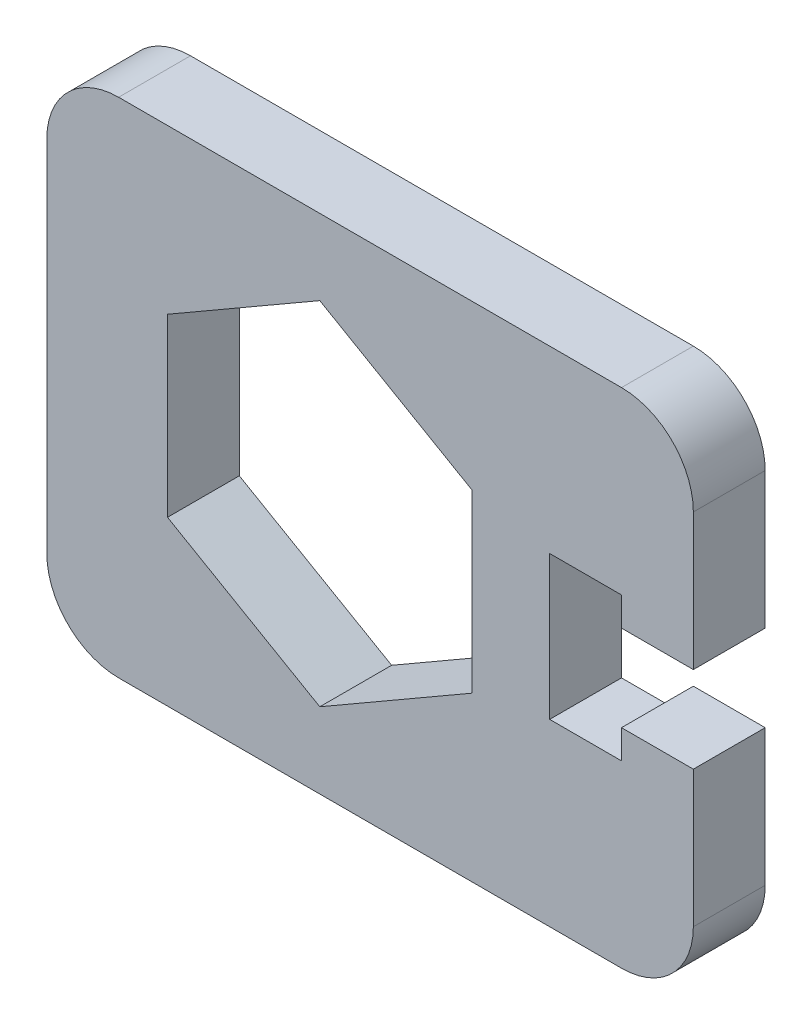
ISO-10303-21;
HEADER;
FILE_DESCRIPTION(('STEP AP214'),'2;1');
FILE_NAME('part.step','',(''),(''),'','','');
FILE_SCHEMA(('AUTOMOTIVE_DESIGN { 1 0 10303 214 1 1 1 1 }'));
ENDSEC;
DATA;
#1=APPLICATION_CONTEXT('core data for automotive mechanical design processes');
#2=APPLICATION_PROTOCOL_DEFINITION('international standard','automotive_design',2000,#1);
#3=PRODUCT_CONTEXT('',#1,'mechanical');
#4=PRODUCT('Part','Part','',(#3));
#5=PRODUCT_RELATED_PRODUCT_CATEGORY('part','',(#4));
#6=PRODUCT_DEFINITION_FORMATION('','',#4);
#7=PRODUCT_DEFINITION_CONTEXT('part definition',#1,'design');
#8=PRODUCT_DEFINITION('design','',#6,#7);
#9=PRODUCT_DEFINITION_SHAPE('','',#8);
#10=(LENGTH_UNIT() NAMED_UNIT(*) SI_UNIT(.MILLI.,.METRE.));
#11=(NAMED_UNIT(*) PLANE_ANGLE_UNIT() SI_UNIT($,.RADIAN.));
#12=(NAMED_UNIT(*) SI_UNIT($,.STERADIAN.) SOLID_ANGLE_UNIT());
#13=UNCERTAINTY_MEASURE_WITH_UNIT(LENGTH_MEASURE(1.E-05),#10,'distance_accuracy_value','');
#14=(GEOMETRIC_REPRESENTATION_CONTEXT(3) GLOBAL_UNCERTAINTY_ASSIGNED_CONTEXT((#13)) GLOBAL_UNIT_ASSIGNED_CONTEXT((#10,
#11,#12)) REPRESENTATION_CONTEXT('',''));
#15=CARTESIAN_POINT('',(0.,0.,0.));
#16=DIRECTION('',(0.,0.,1.));
#17=DIRECTION('',(1.,0.,0.));
#18=AXIS2_PLACEMENT_3D('',#15,#16,#17);
#19=CARTESIAN_POINT('',(0.,0.,2.5));
#20=DIRECTION('',(0.,0.,1.));
#21=DIRECTION('',(1.,0.,0.));
#22=AXIS2_PLACEMENT_3D('',#19,#20,#21);
#23=PLANE('',#22);
#24=DIRECTION('',(0.,1.,0.));
#25=VECTOR('',#24,1.);
#26=CARTESIAN_POINT('',(22.5,3.,2.5));
#27=LINE('',#26,#25);
#28=CARTESIAN_POINT('',(22.5,3.,2.5));
#29=VERTEX_POINT('',#28);
#30=CARTESIAN_POINT('',(22.5,12.5,2.5));
#31=VERTEX_POINT('',#30);
#32=EDGE_CURVE('E266',#29,#31,#27,.T.);
#33=ORIENTED_EDGE('',*,*,#32,.T.);
#34=CARTESIAN_POINT('',(17.5,12.5,2.5));
#35=DIRECTION('',(0.,0.,1.));
#36=DIRECTION('',(1.,0.,0.));
#37=AXIS2_PLACEMENT_3D('',#34,#35,#36);
#38=CIRCLE('',#37,5.);
#39=CARTESIAN_POINT('',(17.5,17.5,2.5));
#40=VERTEX_POINT('',#39);
#41=EDGE_CURVE('E341',#31,#40,#38,.T.);
#42=ORIENTED_EDGE('',*,*,#41,.T.);
#43=DIRECTION('',(-1.,0.,0.));
#44=VECTOR('',#43,1.);
#45=CARTESIAN_POINT('',(22.5,17.5,2.5));
#46=LINE('',#45,#44);
#47=CARTESIAN_POINT('',(-17.5,17.5,2.5));
#48=VERTEX_POINT('',#47);
#49=EDGE_CURVE('E269',#40,#48,#46,.T.);
#50=ORIENTED_EDGE('',*,*,#49,.T.);
#51=CARTESIAN_POINT('',(-17.5,12.5,2.5));
#52=DIRECTION('',(0.,0.,1.));
#53=DIRECTION('',(1.,0.,0.));
#54=AXIS2_PLACEMENT_3D('',#51,#52,#53);
#55=CIRCLE('',#54,5.);
#56=CARTESIAN_POINT('',(-22.5,12.5,2.5));
#57=VERTEX_POINT('',#56);
#58=EDGE_CURVE('E336',#48,#57,#55,.T.);
#59=ORIENTED_EDGE('',*,*,#58,.T.);
#60=DIRECTION('',(0.,-1.,0.));
#61=VECTOR('',#60,1.);
#62=CARTESIAN_POINT('',(-22.5,-17.5,2.5));
#63=LINE('',#62,#61);
#64=CARTESIAN_POINT('',(-22.5,-12.5,2.5));
#65=VERTEX_POINT('',#64);
#66=EDGE_CURVE('E244',#57,#65,#63,.T.);
#67=ORIENTED_EDGE('',*,*,#66,.T.);
#68=CARTESIAN_POINT('',(-17.5,-12.5,2.5));
#69=DIRECTION('',(0.,0.,1.));
#70=DIRECTION('',(1.,0.,0.));
#71=AXIS2_PLACEMENT_3D('',#68,#69,#70);
#72=CIRCLE('',#71,5.);
#73=CARTESIAN_POINT('',(-17.5,-17.5,2.5));
#74=VERTEX_POINT('',#73);
#75=EDGE_CURVE('E338',#65,#74,#72,.T.);
#76=ORIENTED_EDGE('',*,*,#75,.T.);
#77=DIRECTION('',(1.,0.,0.));
#78=VECTOR('',#77,1.);
#79=CARTESIAN_POINT('',(22.5,-17.5,2.5));
#80=LINE('',#79,#78);
#81=CARTESIAN_POINT('',(17.5,-17.5,2.5));
#82=VERTEX_POINT('',#81);
#83=EDGE_CURVE('E247',#74,#82,#80,.T.);
#84=ORIENTED_EDGE('',*,*,#83,.T.);
#85=CARTESIAN_POINT('',(17.5,-12.5,2.5));
#86=DIRECTION('',(0.,0.,1.));
#87=DIRECTION('',(1.,0.,0.));
#88=AXIS2_PLACEMENT_3D('',#85,#86,#87);
#89=CIRCLE('',#88,5.);
#90=CARTESIAN_POINT('',(22.5,-12.5,2.5));
#91=VERTEX_POINT('',#90);
#92=EDGE_CURVE('E52',#82,#91,#89,.T.);
#93=ORIENTED_EDGE('',*,*,#92,.T.);
#94=DIRECTION('',(0.,1.,0.));
#95=VECTOR('',#94,1.);
#96=CARTESIAN_POINT('',(22.5,-17.5,2.5));
#97=LINE('',#96,#95);
#98=CARTESIAN_POINT('',(22.5,-2.99999999999998,2.5));
#99=VERTEX_POINT('',#98);
#100=EDGE_CURVE('E250',#91,#99,#97,.T.);
#101=ORIENTED_EDGE('',*,*,#100,.T.);
#102=DIRECTION('',(-1.,0.,0.));
#103=VECTOR('',#102,1.);
#104=CARTESIAN_POINT('',(17.5,-2.99999999999999,2.5));
#105=LINE('',#104,#103);
#106=CARTESIAN_POINT('',(17.5,-2.99999999999999,2.5));
#107=VERTEX_POINT('',#106);
#108=EDGE_CURVE('E252',#99,#107,#105,.T.);
#109=ORIENTED_EDGE('',*,*,#108,.T.);
#110=DIRECTION('',(0.,-1.,0.));
#111=VECTOR('',#110,1.);
#112=CARTESIAN_POINT('',(17.5,-4.99999999999999,2.5));
#113=LINE('',#112,#111);
#114=CARTESIAN_POINT('',(17.5,-4.99999999999999,2.5));
#115=VERTEX_POINT('',#114);
#116=EDGE_CURVE('E254',#107,#115,#113,.T.);
#117=ORIENTED_EDGE('',*,*,#116,.T.);
#118=DIRECTION('',(-1.,0.,0.));
#119=VECTOR('',#118,1.);
#120=CARTESIAN_POINT('',(12.5,-4.99999999999999,2.5));
#121=LINE('',#120,#119);
#122=CARTESIAN_POINT('',(12.5,-4.99999999999999,2.5));
#123=VERTEX_POINT('',#122);
#124=EDGE_CURVE('E256',#115,#123,#121,.T.);
#125=ORIENTED_EDGE('',*,*,#124,.T.);
#126=DIRECTION('',(0.,1.,0.));
#127=VECTOR('',#126,1.);
#128=CARTESIAN_POINT('',(12.5,5.,2.5));
#129=LINE('',#128,#127);
#130=CARTESIAN_POINT('',(12.5,5.,2.5));
#131=VERTEX_POINT('',#130);
#132=EDGE_CURVE('E258',#123,#131,#129,.T.);
#133=ORIENTED_EDGE('',*,*,#132,.T.);
#134=DIRECTION('',(1.,0.,0.));
#135=VECTOR('',#134,1.);
#136=CARTESIAN_POINT('',(17.5,5.,2.5));
#137=LINE('',#136,#135);
#138=CARTESIAN_POINT('',(17.5,5.,2.5));
#139=VERTEX_POINT('',#138);
#140=EDGE_CURVE('E260',#131,#139,#137,.T.);
#141=ORIENTED_EDGE('',*,*,#140,.T.);
#142=DIRECTION('',(0.,-1.,0.));
#143=VECTOR('',#142,1.);
#144=CARTESIAN_POINT('',(17.5,3.,2.5));
#145=LINE('',#144,#143);
#146=CARTESIAN_POINT('',(17.5,3.,2.5));
#147=VERTEX_POINT('',#146);
#148=EDGE_CURVE('E262',#139,#147,#145,.T.);
#149=ORIENTED_EDGE('',*,*,#148,.T.);
#150=DIRECTION('',(1.,0.,0.));
#151=VECTOR('',#150,1.);
#152=CARTESIAN_POINT('',(17.5,3.,2.5));
#153=LINE('',#152,#151);
#154=EDGE_CURVE('E264',#147,#29,#153,.T.);
#155=ORIENTED_EDGE('',*,*,#154,.T.);
#156=EDGE_LOOP('',(#33,#42,#50,#59,#67,#76,#84,#93,#101,#109,#117,#125,#133,#141,#149,#155));
#157=FACE_BOUND('',#156,.T.);
#158=DIRECTION('',(-0.866025403784439,0.5,0.));
#159=VECTOR('',#158,1.);
#160=CARTESIAN_POINT('',(7.1,6.11991285341003,2.5));
#161=LINE('',#160,#159);
#162=CARTESIAN_POINT('',(7.1,6.11991285341003,2.5));
#163=VERTEX_POINT('',#162);
#164=CARTESIAN_POINT('',(-3.5,12.2398257068201,2.5));
#165=VERTEX_POINT('',#164);
#166=EDGE_CURVE('E198',#163,#165,#161,.T.);
#167=ORIENTED_EDGE('',*,*,#166,.F.);
#168=DIRECTION('',(0.,1.,0.));
#169=VECTOR('',#168,1.);
#170=CARTESIAN_POINT('',(7.1,-6.11991285341003,2.5));
#171=LINE('',#170,#169);
#172=CARTESIAN_POINT('',(7.1,-6.11991285341003,2.5));
#173=VERTEX_POINT('',#172);
#174=EDGE_CURVE('E188',#173,#163,#171,.T.);
#175=ORIENTED_EDGE('',*,*,#174,.F.);
#176=DIRECTION('',(0.866025403784438,0.5,0.));
#177=VECTOR('',#176,1.);
#178=CARTESIAN_POINT('',(-3.5,-12.2398257068201,2.5));
#179=LINE('',#178,#177);
#180=CARTESIAN_POINT('',(-3.5,-12.2398257068201,2.5));
#181=VERTEX_POINT('',#180);
#182=EDGE_CURVE('E220',#181,#173,#179,.T.);
#183=ORIENTED_EDGE('',*,*,#182,.F.);
#184=DIRECTION('',(0.866025403784439,-0.5,0.));
#185=VECTOR('',#184,1.);
#186=CARTESIAN_POINT('',(-14.1,-6.11991285341004,2.5));
#187=LINE('',#186,#185);
#188=CARTESIAN_POINT('',(-14.1,-6.11991285341004,2.5));
#189=VERTEX_POINT('',#188);
#190=EDGE_CURVE('E217',#189,#181,#187,.T.);
#191=ORIENTED_EDGE('',*,*,#190,.F.);
#192=DIRECTION('',(0.,-1.,0.));
#193=VECTOR('',#192,1.);
#194=CARTESIAN_POINT('',(-14.1,6.11991285341008,2.5));
#195=LINE('',#194,#193);
#196=CARTESIAN_POINT('',(-14.1,6.11991285341008,2.5));
#197=VERTEX_POINT('',#196);
#198=EDGE_CURVE('E213',#197,#189,#195,.T.);
#199=ORIENTED_EDGE('',*,*,#198,.F.);
#200=DIRECTION('',(-0.866025403784438,-0.5,0.));
#201=VECTOR('',#200,1.);
#202=CARTESIAN_POINT('',(-3.5,12.2398257068201,2.5));
#203=LINE('',#202,#201);
#204=EDGE_CURVE('E211',#165,#197,#203,.T.);
#205=ORIENTED_EDGE('',*,*,#204,.F.);
#206=EDGE_LOOP('',(#167,#175,#183,#191,#199,#205));
#207=FACE_BOUND('',#206,.T.);
#208=ADVANCED_FACE('F37',(#157,#207),#23,.T.);
#209=CARTESIAN_POINT('',(0.,0.,-2.5));
#210=DIRECTION('',(0.,0.,1.));
#211=DIRECTION('',(1.,0.,0.));
#212=AXIS2_PLACEMENT_3D('',#209,#210,#211);
#213=PLANE('',#212);
#214=DIRECTION('',(-1.,0.,0.));
#215=VECTOR('',#214,1.);
#216=CARTESIAN_POINT('',(22.5,17.5,-2.49999999999997));
#217=LINE('',#216,#215);
#218=CARTESIAN_POINT('',(17.5,17.5,-2.5));
#219=VERTEX_POINT('',#218);
#220=CARTESIAN_POINT('',(-17.5,17.5,-2.5));
#221=VERTEX_POINT('',#220);
#222=EDGE_CURVE('E248',#219,#221,#217,.T.);
#223=ORIENTED_EDGE('',*,*,#222,.F.);
#224=CARTESIAN_POINT('',(17.5,12.5,-2.5));
#225=DIRECTION('',(0.,0.,1.));
#226=DIRECTION('',(1.,0.,0.));
#227=AXIS2_PLACEMENT_3D('',#224,#225,#226);
#228=CIRCLE('',#227,5.);
#229=CARTESIAN_POINT('',(22.5,12.5,-2.5));
#230=VERTEX_POINT('',#229);
#231=EDGE_CURVE('E332',#219,#230,#228,.F.);
#232=ORIENTED_EDGE('',*,*,#231,.T.);
#233=DIRECTION('',(0.,1.,0.));
#234=VECTOR('',#233,1.);
#235=CARTESIAN_POINT('',(22.5,3.,-2.5));
#236=LINE('',#235,#234);
#237=CARTESIAN_POINT('',(22.5,3.,-2.5));
#238=VERTEX_POINT('',#237);
#239=EDGE_CURVE('E293',#238,#230,#236,.T.);
#240=ORIENTED_EDGE('',*,*,#239,.F.);
#241=DIRECTION('',(1.,0.,0.));
#242=VECTOR('',#241,1.);
#243=CARTESIAN_POINT('',(17.5,3.,-2.5));
#244=LINE('',#243,#242);
#245=CARTESIAN_POINT('',(17.5,3.,-2.5));
#246=VERTEX_POINT('',#245);
#247=EDGE_CURVE('E291',#246,#238,#244,.T.);
#248=ORIENTED_EDGE('',*,*,#247,.F.);
#249=DIRECTION('',(0.,-1.,0.));
#250=VECTOR('',#249,1.);
#251=CARTESIAN_POINT('',(17.5,3.,-2.5));
#252=LINE('',#251,#250);
#253=CARTESIAN_POINT('',(17.5,5.,-2.5));
#254=VERTEX_POINT('',#253);
#255=EDGE_CURVE('E289',#254,#246,#252,.T.);
#256=ORIENTED_EDGE('',*,*,#255,.F.);
#257=DIRECTION('',(1.,0.,0.));
#258=VECTOR('',#257,1.);
#259=CARTESIAN_POINT('',(17.5,5.,-2.5));
#260=LINE('',#259,#258);
#261=CARTESIAN_POINT('',(12.5,5.,-2.5));
#262=VERTEX_POINT('',#261);
#263=EDGE_CURVE('E287',#262,#254,#260,.T.);
#264=ORIENTED_EDGE('',*,*,#263,.F.);
#265=DIRECTION('',(0.,1.,0.));
#266=VECTOR('',#265,1.);
#267=CARTESIAN_POINT('',(12.5,5.,-2.5));
#268=LINE('',#267,#266);
#269=CARTESIAN_POINT('',(12.5,-4.99999999999999,-2.5));
#270=VERTEX_POINT('',#269);
#271=EDGE_CURVE('E285',#270,#262,#268,.T.);
#272=ORIENTED_EDGE('',*,*,#271,.F.);
#273=DIRECTION('',(-1.,0.,0.));
#274=VECTOR('',#273,1.);
#275=CARTESIAN_POINT('',(12.5,-4.99999999999999,-2.5));
#276=LINE('',#275,#274);
#277=CARTESIAN_POINT('',(17.5,-4.99999999999999,-2.5));
#278=VERTEX_POINT('',#277);
#279=EDGE_CURVE('E283',#278,#270,#276,.T.);
#280=ORIENTED_EDGE('',*,*,#279,.F.);
#281=DIRECTION('',(0.,-1.,0.));
#282=VECTOR('',#281,1.);
#283=CARTESIAN_POINT('',(17.5,-4.99999999999999,-2.5));
#284=LINE('',#283,#282);
#285=CARTESIAN_POINT('',(17.5,-3.,-2.5));
#286=VERTEX_POINT('',#285);
#287=EDGE_CURVE('E281',#286,#278,#284,.T.);
#288=ORIENTED_EDGE('',*,*,#287,.F.);
#289=DIRECTION('',(-1.,0.,0.));
#290=VECTOR('',#289,1.);
#291=CARTESIAN_POINT('',(17.5,-3.,-2.5));
#292=LINE('',#291,#290);
#293=CARTESIAN_POINT('',(22.5,-2.99999999999999,-2.5));
#294=VERTEX_POINT('',#293);
#295=EDGE_CURVE('E279',#294,#286,#292,.T.);
#296=ORIENTED_EDGE('',*,*,#295,.F.);
#297=DIRECTION('',(0.,1.,0.));
#298=VECTOR('',#297,1.);
#299=CARTESIAN_POINT('',(22.5,-17.5,-2.5));
#300=LINE('',#299,#298);
#301=CARTESIAN_POINT('',(22.5,-12.5,-2.5));
#302=VERTEX_POINT('',#301);
#303=EDGE_CURVE('E277',#302,#294,#300,.T.);
#304=ORIENTED_EDGE('',*,*,#303,.F.);
#305=CARTESIAN_POINT('',(17.5,-12.5,-2.5));
#306=DIRECTION('',(0.,0.,1.));
#307=DIRECTION('',(1.,0.,0.));
#308=AXIS2_PLACEMENT_3D('',#305,#306,#307);
#309=CIRCLE('',#308,5.);
#310=CARTESIAN_POINT('',(17.5,-17.5,-2.5));
#311=VERTEX_POINT('',#310);
#312=EDGE_CURVE('E330',#302,#311,#309,.F.);
#313=ORIENTED_EDGE('',*,*,#312,.T.);
#314=DIRECTION('',(1.,0.,0.));
#315=VECTOR('',#314,1.);
#316=CARTESIAN_POINT('',(22.5,-17.5,-2.5));
#317=LINE('',#316,#315);
#318=CARTESIAN_POINT('',(-17.5,-17.5,-2.5));
#319=VERTEX_POINT('',#318);
#320=EDGE_CURVE('E275',#319,#311,#317,.T.);
#321=ORIENTED_EDGE('',*,*,#320,.F.);
#322=CARTESIAN_POINT('',(-17.5,-12.5,-2.5));
#323=DIRECTION('',(0.,0.,1.));
#324=DIRECTION('',(1.,0.,0.));
#325=AXIS2_PLACEMENT_3D('',#322,#323,#324);
#326=CIRCLE('',#325,5.);
#327=CARTESIAN_POINT('',(-22.5,-12.5,-2.5));
#328=VERTEX_POINT('',#327);
#329=EDGE_CURVE('E328',#319,#328,#326,.F.);
#330=ORIENTED_EDGE('',*,*,#329,.T.);
#331=DIRECTION('',(0.,-1.,0.));
#332=VECTOR('',#331,1.);
#333=CARTESIAN_POINT('',(-22.5,-17.5,-2.5));
#334=LINE('',#333,#332);
#335=CARTESIAN_POINT('',(-22.5,12.5,-2.5));
#336=VERTEX_POINT('',#335);
#337=EDGE_CURVE('E206',#336,#328,#334,.T.);
#338=ORIENTED_EDGE('',*,*,#337,.F.);
#339=CARTESIAN_POINT('',(-17.5,12.5,-2.5));
#340=DIRECTION('',(0.,0.,1.));
#341=DIRECTION('',(1.,0.,0.));
#342=AXIS2_PLACEMENT_3D('',#339,#340,#341);
#343=CIRCLE('',#342,5.);
#344=EDGE_CURVE('E326',#336,#221,#343,.F.);
#345=ORIENTED_EDGE('',*,*,#344,.T.);
#346=EDGE_LOOP('',(#223,#232,#240,#248,#256,#264,#272,#280,#288,#296,#304,#313,#321,#330,#338,#345));
#347=FACE_BOUND('',#346,.T.);
#348=DIRECTION('',(0.,1.,0.));
#349=VECTOR('',#348,1.);
#350=CARTESIAN_POINT('',(7.1,-6.11991285340999,-2.5));
#351=LINE('',#350,#349);
#352=CARTESIAN_POINT('',(7.1,-6.11991285340999,-2.5));
#353=VERTEX_POINT('',#352);
#354=CARTESIAN_POINT('',(7.1,6.11991285341003,-2.5));
#355=VERTEX_POINT('',#354);
#356=EDGE_CURVE('E222',#353,#355,#351,.T.);
#357=ORIENTED_EDGE('',*,*,#356,.T.);
#358=DIRECTION('',(-0.866025403784439,0.5,0.));
#359=VECTOR('',#358,1.);
#360=CARTESIAN_POINT('',(7.1,6.11991285341003,-2.5));
#361=LINE('',#360,#359);
#362=CARTESIAN_POINT('',(-3.5,12.2398257068201,-2.5));
#363=VERTEX_POINT('',#362);
#364=EDGE_CURVE('E205',#355,#363,#361,.T.);
#365=ORIENTED_EDGE('',*,*,#364,.T.);
#366=DIRECTION('',(-0.866025403784438,-0.5,0.));
#367=VECTOR('',#366,1.);
#368=CARTESIAN_POINT('',(-3.5,12.2398257068201,-2.5));
#369=LINE('',#368,#367);
#370=CARTESIAN_POINT('',(-14.1,6.11991285341008,-2.5));
#371=VERTEX_POINT('',#370);
#372=EDGE_CURVE('E225',#363,#371,#369,.T.);
#373=ORIENTED_EDGE('',*,*,#372,.T.);
#374=DIRECTION('',(0.,-1.,0.));
#375=VECTOR('',#374,1.);
#376=CARTESIAN_POINT('',(-14.1,6.11991285341008,-2.5));
#377=LINE('',#376,#375);
#378=CARTESIAN_POINT('',(-14.1,-6.11991285341003,-2.5));
#379=VERTEX_POINT('',#378);
#380=EDGE_CURVE('E228',#371,#379,#377,.T.);
#381=ORIENTED_EDGE('',*,*,#380,.T.);
#382=DIRECTION('',(0.866025403784439,-0.5,0.));
#383=VECTOR('',#382,1.);
#384=CARTESIAN_POINT('',(-14.1,-6.11991285341003,-2.5));
#385=LINE('',#384,#383);
#386=CARTESIAN_POINT('',(-3.5,-12.2398257068201,-2.5));
#387=VERTEX_POINT('',#386);
#388=EDGE_CURVE('E231',#379,#387,#385,.T.);
#389=ORIENTED_EDGE('',*,*,#388,.T.);
#390=DIRECTION('',(0.866025403784438,0.5,0.));
#391=VECTOR('',#390,1.);
#392=CARTESIAN_POINT('',(-3.5,-12.2398257068201,-2.5));
#393=LINE('',#392,#391);
#394=EDGE_CURVE('E199',#387,#353,#393,.T.);
#395=ORIENTED_EDGE('',*,*,#394,.T.);
#396=EDGE_LOOP('',(#357,#365,#373,#381,#389,#395));
#397=FACE_BOUND('',#396,.T.);
#398=ADVANCED_FACE('F360',(#347,#397),#213,.F.);
#399=CARTESIAN_POINT('',(-22.5,-17.5,2.5));
#400=DIRECTION('',(1.,0.,0.));
#401=DIRECTION('',(0.,0.,-1.));
#402=AXIS2_PLACEMENT_3D('',#399,#400,#401);
#403=PLANE('',#402);
#404=ORIENTED_EDGE('',*,*,#337,.T.);
#405=DIRECTION('',(0.,0.,-1.));
#406=VECTOR('',#405,1.);
#407=CARTESIAN_POINT('',(-22.5,-12.5,2.5));
#408=LINE('',#407,#406);
#409=EDGE_CURVE('E11',#328,#65,#408,.F.);
#410=ORIENTED_EDGE('',*,*,#409,.T.);
#411=ORIENTED_EDGE('',*,*,#66,.F.);
#412=DIRECTION('',(0.,0.,-1.));
#413=VECTOR('',#412,1.);
#414=CARTESIAN_POINT('',(-22.5,12.5,2.5));
#415=LINE('',#414,#413);
#416=EDGE_CURVE('E45',#57,#336,#415,.T.);
#417=ORIENTED_EDGE('',*,*,#416,.T.);
#418=EDGE_LOOP('',(#404,#410,#411,#417));
#419=FACE_BOUND('',#418,.T.);
#420=ADVANCED_FACE('F354',(#419),#403,.F.);
#421=CARTESIAN_POINT('',(22.5,-17.5,2.5));
#422=DIRECTION('',(0.,1.,0.));
#423=DIRECTION('',(-1.,0.,0.));
#424=AXIS2_PLACEMENT_3D('',#421,#422,#423);
#425=PLANE('',#424);
#426=ORIENTED_EDGE('',*,*,#320,.T.);
#427=DIRECTION('',(0.,0.,-1.));
#428=VECTOR('',#427,1.);
#429=CARTESIAN_POINT('',(17.5,-17.5,2.5));
#430=LINE('',#429,#428);
#431=EDGE_CURVE('E60',#311,#82,#430,.F.);
#432=ORIENTED_EDGE('',*,*,#431,.T.);
#433=ORIENTED_EDGE('',*,*,#83,.F.);
#434=DIRECTION('',(0.,0.,-1.));
#435=VECTOR('',#434,1.);
#436=CARTESIAN_POINT('',(-17.5,-17.5,2.5));
#437=LINE('',#436,#435);
#438=EDGE_CURVE('E346',#74,#319,#437,.T.);
#439=ORIENTED_EDGE('',*,*,#438,.T.);
#440=EDGE_LOOP('',(#426,#432,#433,#439));
#441=FACE_BOUND('',#440,.T.);
#442=ADVANCED_FACE('F367',(#441),#425,.F.);
#443=CARTESIAN_POINT('',(22.5,-17.5,2.5));
#444=DIRECTION('',(-1.,0.,0.));
#445=DIRECTION('',(0.,0.,1.));
#446=AXIS2_PLACEMENT_3D('',#443,#444,#445);
#447=PLANE('',#446);
#448=ORIENTED_EDGE('',*,*,#100,.F.);
#449=DIRECTION('',(0.,0.,-1.));
#450=VECTOR('',#449,1.);
#451=CARTESIAN_POINT('',(22.5,-12.5,2.5));
#452=LINE('',#451,#450);
#453=EDGE_CURVE('E343',#91,#302,#452,.T.);
#454=ORIENTED_EDGE('',*,*,#453,.T.);
#455=ORIENTED_EDGE('',*,*,#303,.T.);
#456=DIRECTION('',(0.,0.,-1.));
#457=VECTOR('',#456,1.);
#458=CARTESIAN_POINT('',(22.5,-2.99999999999998,2.5));
#459=LINE('',#458,#457);
#460=EDGE_CURVE('E318',#99,#294,#459,.T.);
#461=ORIENTED_EDGE('',*,*,#460,.F.);
#462=EDGE_LOOP('',(#448,#454,#455,#461));
#463=FACE_BOUND('',#462,.T.);
#464=ADVANCED_FACE('F373',(#463),#447,.F.);
#465=CARTESIAN_POINT('',(17.5,-2.99999999999999,2.5));
#466=DIRECTION('',(0.,-1.,0.));
#467=DIRECTION('',(0.,0.,-1.));
#468=AXIS2_PLACEMENT_3D('',#465,#466,#467);
#469=PLANE('',#468);
#470=ORIENTED_EDGE('',*,*,#295,.T.);
#471=DIRECTION('',(0.,0.,-1.));
#472=VECTOR('',#471,1.);
#473=CARTESIAN_POINT('',(17.5,-2.99999999999999,2.5));
#474=LINE('',#473,#472);
#475=EDGE_CURVE('E315',#107,#286,#474,.T.);
#476=ORIENTED_EDGE('',*,*,#475,.F.);
#477=ORIENTED_EDGE('',*,*,#108,.F.);
#478=ORIENTED_EDGE('',*,*,#460,.T.);
#479=EDGE_LOOP('',(#470,#476,#477,#478));
#480=FACE_BOUND('',#479,.T.);
#481=ADVANCED_FACE('F380',(#480),#469,.F.);
#482=CARTESIAN_POINT('',(17.5,-4.99999999999999,2.5));
#483=DIRECTION('',(1.,0.,0.));
#484=DIRECTION('',(0.,0.,-1.));
#485=AXIS2_PLACEMENT_3D('',#482,#483,#484);
#486=PLANE('',#485);
#487=ORIENTED_EDGE('',*,*,#287,.T.);
#488=DIRECTION('',(0.,0.,-1.));
#489=VECTOR('',#488,1.);
#490=CARTESIAN_POINT('',(17.5,-4.99999999999999,2.5));
#491=LINE('',#490,#489);
#492=EDGE_CURVE('E312',#115,#278,#491,.T.);
#493=ORIENTED_EDGE('',*,*,#492,.F.);
#494=ORIENTED_EDGE('',*,*,#116,.F.);
#495=ORIENTED_EDGE('',*,*,#475,.T.);
#496=EDGE_LOOP('',(#487,#493,#494,#495));
#497=FACE_BOUND('',#496,.T.);
#498=ADVANCED_FACE('F384',(#497),#486,.F.);
#499=CARTESIAN_POINT('',(12.5,-4.99999999999999,2.5));
#500=DIRECTION('',(0.,-1.,0.));
#501=DIRECTION('',(1.,0.,0.));
#502=AXIS2_PLACEMENT_3D('',#499,#500,#501);
#503=PLANE('',#502);
#504=ORIENTED_EDGE('',*,*,#279,.T.);
#505=DIRECTION('',(0.,0.,-1.));
#506=VECTOR('',#505,1.);
#507=CARTESIAN_POINT('',(12.5,-4.99999999999999,2.5));
#508=LINE('',#507,#506);
#509=EDGE_CURVE('E309',#123,#270,#508,.T.);
#510=ORIENTED_EDGE('',*,*,#509,.F.);
#511=ORIENTED_EDGE('',*,*,#124,.F.);
#512=ORIENTED_EDGE('',*,*,#492,.T.);
#513=EDGE_LOOP('',(#504,#510,#511,#512));
#514=FACE_BOUND('',#513,.T.);
#515=ADVANCED_FACE('F391',(#514),#503,.F.);
#516=CARTESIAN_POINT('',(12.5,5.,2.5));
#517=DIRECTION('',(-1.,0.,0.));
#518=DIRECTION('',(0.,-1.,0.));
#519=AXIS2_PLACEMENT_3D('',#516,#517,#518);
#520=PLANE('',#519);
#521=ORIENTED_EDGE('',*,*,#271,.T.);
#522=DIRECTION('',(0.,0.,-1.));
#523=VECTOR('',#522,1.);
#524=CARTESIAN_POINT('',(12.5,5.,2.5));
#525=LINE('',#524,#523);
#526=EDGE_CURVE('E306',#131,#262,#525,.T.);
#527=ORIENTED_EDGE('',*,*,#526,.F.);
#528=ORIENTED_EDGE('',*,*,#132,.F.);
#529=ORIENTED_EDGE('',*,*,#509,.T.);
#530=EDGE_LOOP('',(#521,#527,#528,#529));
#531=FACE_BOUND('',#530,.T.);
#532=ADVANCED_FACE('F394',(#531),#520,.F.);
#533=CARTESIAN_POINT('',(17.5,5.,2.5));
#534=DIRECTION('',(0.,1.,0.));
#535=DIRECTION('',(0.,0.,1.));
#536=AXIS2_PLACEMENT_3D('',#533,#534,#535);
#537=PLANE('',#536);
#538=ORIENTED_EDGE('',*,*,#263,.T.);
#539=DIRECTION('',(0.,0.,-1.));
#540=VECTOR('',#539,1.);
#541=CARTESIAN_POINT('',(17.5,5.,2.5));
#542=LINE('',#541,#540);
#543=EDGE_CURVE('E303',#139,#254,#542,.T.);
#544=ORIENTED_EDGE('',*,*,#543,.F.);
#545=ORIENTED_EDGE('',*,*,#140,.F.);
#546=ORIENTED_EDGE('',*,*,#526,.T.);
#547=EDGE_LOOP('',(#538,#544,#545,#546));
#548=FACE_BOUND('',#547,.T.);
#549=ADVANCED_FACE('F399',(#548),#537,.F.);
#550=CARTESIAN_POINT('',(17.5,3.,2.5));
#551=DIRECTION('',(1.,0.,0.));
#552=DIRECTION('',(0.,0.,-1.));
#553=AXIS2_PLACEMENT_3D('',#550,#551,#552);
#554=PLANE('',#553);
#555=ORIENTED_EDGE('',*,*,#255,.T.);
#556=DIRECTION('',(0.,0.,-1.));
#557=VECTOR('',#556,1.);
#558=CARTESIAN_POINT('',(17.5,3.,2.5));
#559=LINE('',#558,#557);
#560=EDGE_CURVE('E300',#147,#246,#559,.T.);
#561=ORIENTED_EDGE('',*,*,#560,.F.);
#562=ORIENTED_EDGE('',*,*,#148,.F.);
#563=ORIENTED_EDGE('',*,*,#543,.T.);
#564=EDGE_LOOP('',(#555,#561,#562,#563));
#565=FACE_BOUND('',#564,.T.);
#566=ADVANCED_FACE('F405',(#565),#554,.F.);
#567=CARTESIAN_POINT('',(17.5,3.,2.5));
#568=DIRECTION('',(0.,1.,0.));
#569=DIRECTION('',(0.,0.,1.));
#570=AXIS2_PLACEMENT_3D('',#567,#568,#569);
#571=PLANE('',#570);
#572=ORIENTED_EDGE('',*,*,#247,.T.);
#573=DIRECTION('',(0.,0.,-1.));
#574=VECTOR('',#573,1.);
#575=CARTESIAN_POINT('',(22.5,3.,2.5));
#576=LINE('',#575,#574);
#577=EDGE_CURVE('E272',#29,#238,#576,.T.);
#578=ORIENTED_EDGE('',*,*,#577,.F.);
#579=ORIENTED_EDGE('',*,*,#154,.F.);
#580=ORIENTED_EDGE('',*,*,#560,.T.);
#581=EDGE_LOOP('',(#572,#578,#579,#580));
#582=FACE_BOUND('',#581,.T.);
#583=ADVANCED_FACE('F409',(#582),#571,.F.);
#584=CARTESIAN_POINT('',(22.5,3.,2.5));
#585=DIRECTION('',(-1.,0.,0.));
#586=DIRECTION('',(0.,0.,1.));
#587=AXIS2_PLACEMENT_3D('',#584,#585,#586);
#588=PLANE('',#587);
#589=ORIENTED_EDGE('',*,*,#239,.T.);
#590=DIRECTION('',(0.,0.,-1.));
#591=VECTOR('',#590,1.);
#592=CARTESIAN_POINT('',(22.5,12.5,2.5));
#593=LINE('',#592,#591);
#594=EDGE_CURVE('E334',#230,#31,#593,.F.);
#595=ORIENTED_EDGE('',*,*,#594,.T.);
#596=ORIENTED_EDGE('',*,*,#32,.F.);
#597=ORIENTED_EDGE('',*,*,#577,.T.);
#598=EDGE_LOOP('',(#589,#595,#596,#597));
#599=FACE_BOUND('',#598,.T.);
#600=ADVANCED_FACE('F413',(#599),#588,.F.);
#601=CARTESIAN_POINT('',(22.5,17.5,2.5));
#602=DIRECTION('',(0.,-1.,0.));
#603=DIRECTION('',(1.,0.,0.));
#604=AXIS2_PLACEMENT_3D('',#601,#602,#603);
#605=PLANE('',#604);
#606=ORIENTED_EDGE('',*,*,#49,.F.);
#607=DIRECTION('',(0.,0.,-1.));
#608=VECTOR('',#607,1.);
#609=CARTESIAN_POINT('',(17.5,17.5,2.5));
#610=LINE('',#609,#608);
#611=EDGE_CURVE('E323',#40,#219,#610,.T.);
#612=ORIENTED_EDGE('',*,*,#611,.T.);
#613=ORIENTED_EDGE('',*,*,#222,.T.);
#614=DIRECTION('',(0.,0.,-1.));
#615=VECTOR('',#614,1.);
#616=CARTESIAN_POINT('',(-17.5,17.5,2.5));
#617=LINE('',#616,#615);
#618=EDGE_CURVE('E321',#221,#48,#617,.F.);
#619=ORIENTED_EDGE('',*,*,#618,.T.);
#620=EDGE_LOOP('',(#606,#612,#613,#619));
#621=FACE_BOUND('',#620,.T.);
#622=ADVANCED_FACE('F421',(#621),#605,.F.);
#623=CARTESIAN_POINT('',(7.1,-6.11991285341003,2.5));
#624=DIRECTION('',(-1.,0.,0.));
#625=DIRECTION('',(0.,-1.,0.));
#626=AXIS2_PLACEMENT_3D('',#623,#624,#625);
#627=PLANE('',#626);
#628=ORIENTED_EDGE('',*,*,#356,.F.);
#629=DIRECTION('',(0.,0.,-1.));
#630=VECTOR('',#629,1.);
#631=CARTESIAN_POINT('',(7.1,-6.11991285341003,2.5));
#632=LINE('',#631,#630);
#633=EDGE_CURVE('E194',#173,#353,#632,.T.);
#634=ORIENTED_EDGE('',*,*,#633,.F.);
#635=ORIENTED_EDGE('',*,*,#174,.T.);
#636=DIRECTION('',(0.,0.,-1.));
#637=VECTOR('',#636,1.);
#638=CARTESIAN_POINT('',(7.1,6.11991285341003,2.5));
#639=LINE('',#638,#637);
#640=EDGE_CURVE('E191',#163,#355,#639,.T.);
#641=ORIENTED_EDGE('',*,*,#640,.T.);
#642=EDGE_LOOP('',(#628,#634,#635,#641));
#643=FACE_BOUND('',#642,.T.);
#644=ADVANCED_FACE('F190',(#643),#627,.T.);
#645=CARTESIAN_POINT('',(7.1,6.11991285341003,2.5));
#646=DIRECTION('',(-0.5,-0.866025403784438,0.));
#647=DIRECTION('',(0.866025403784439,-0.5,0.));
#648=AXIS2_PLACEMENT_3D('',#645,#646,#647);
#649=PLANE('',#648);
#650=ORIENTED_EDGE('',*,*,#364,.F.);
#651=ORIENTED_EDGE('',*,*,#640,.F.);
#652=ORIENTED_EDGE('',*,*,#166,.T.);
#653=DIRECTION('',(0.,0.,-1.));
#654=VECTOR('',#653,1.);
#655=CARTESIAN_POINT('',(-3.5,12.2398257068201,2.5));
#656=LINE('',#655,#654);
#657=EDGE_CURVE('E207',#165,#363,#656,.T.);
#658=ORIENTED_EDGE('',*,*,#657,.T.);
#659=EDGE_LOOP('',(#650,#651,#652,#658));
#660=FACE_BOUND('',#659,.T.);
#661=ADVANCED_FACE('F202',(#660),#649,.T.);
#662=CARTESIAN_POINT('',(-3.5,12.2398257068201,2.5));
#663=DIRECTION('',(0.5,-0.866025403784438,0.));
#664=DIRECTION('',(0.866025403784439,0.5,0.));
#665=AXIS2_PLACEMENT_3D('',#662,#663,#664);
#666=PLANE('',#665);
#667=ORIENTED_EDGE('',*,*,#372,.F.);
#668=ORIENTED_EDGE('',*,*,#657,.F.);
#669=ORIENTED_EDGE('',*,*,#204,.T.);
#670=DIRECTION('',(0.,0.,-1.));
#671=VECTOR('',#670,1.);
#672=CARTESIAN_POINT('',(-14.1,6.11991285341008,2.5));
#673=LINE('',#672,#671);
#674=EDGE_CURVE('E241',#197,#371,#673,.T.);
#675=ORIENTED_EDGE('',*,*,#674,.T.);
#676=EDGE_LOOP('',(#667,#668,#669,#675));
#677=FACE_BOUND('',#676,.T.);
#678=ADVANCED_FACE('F498',(#677),#666,.T.);
#679=CARTESIAN_POINT('',(-14.1,6.11991285341008,2.5));
#680=DIRECTION('',(1.,0.,0.));
#681=DIRECTION('',(0.,0.,-1.));
#682=AXIS2_PLACEMENT_3D('',#679,#680,#681);
#683=PLANE('',#682);
#684=ORIENTED_EDGE('',*,*,#380,.F.);
#685=ORIENTED_EDGE('',*,*,#674,.F.);
#686=ORIENTED_EDGE('',*,*,#198,.T.);
#687=DIRECTION('',(0.,0.,-1.));
#688=VECTOR('',#687,1.);
#689=CARTESIAN_POINT('',(-14.1,-6.11991285341004,2.5));
#690=LINE('',#689,#688);
#691=EDGE_CURVE('E239',#189,#379,#690,.T.);
#692=ORIENTED_EDGE('',*,*,#691,.T.);
#693=EDGE_LOOP('',(#684,#685,#686,#692));
#694=FACE_BOUND('',#693,.T.);
#695=ADVANCED_FACE('F490',(#694),#683,.T.);
#696=CARTESIAN_POINT('',(-14.1,-6.11991285341004,2.5));
#697=DIRECTION('',(0.5,0.866025403784439,0.));
#698=DIRECTION('',(-0.866025403784439,0.5,0.));
#699=AXIS2_PLACEMENT_3D('',#696,#697,#698);
#700=PLANE('',#699);
#701=ORIENTED_EDGE('',*,*,#388,.F.);
#702=ORIENTED_EDGE('',*,*,#691,.F.);
#703=ORIENTED_EDGE('',*,*,#190,.T.);
#704=DIRECTION('',(0.,0.,-1.));
#705=VECTOR('',#704,1.);
#706=CARTESIAN_POINT('',(-3.5,-12.2398257068201,2.5));
#707=LINE('',#706,#705);
#708=EDGE_CURVE('E237',#181,#387,#707,.T.);
#709=ORIENTED_EDGE('',*,*,#708,.T.);
#710=EDGE_LOOP('',(#701,#702,#703,#709));
#711=FACE_BOUND('',#710,.T.);
#712=ADVANCED_FACE('F482',(#711),#700,.T.);
#713=CARTESIAN_POINT('',(-3.5,-12.2398257068201,2.5));
#714=DIRECTION('',(-0.5,0.866025403784439,0.));
#715=DIRECTION('',(-0.866025403784439,-0.5,0.));
#716=AXIS2_PLACEMENT_3D('',#713,#714,#715);
#717=PLANE('',#716);
#718=ORIENTED_EDGE('',*,*,#394,.F.);
#719=ORIENTED_EDGE('',*,*,#708,.F.);
#720=ORIENTED_EDGE('',*,*,#182,.T.);
#721=ORIENTED_EDGE('',*,*,#633,.T.);
#722=EDGE_LOOP('',(#718,#719,#720,#721));
#723=FACE_BOUND('',#722,.T.);
#724=ADVANCED_FACE('F462',(#723),#717,.T.);
#725=CARTESIAN_POINT('',(17.5,12.5,2.5));
#726=DIRECTION('',(0.,0.,-1.));
#727=DIRECTION('',(-1.,0.,0.));
#728=AXIS2_PLACEMENT_3D('',#725,#726,#727);
#729=CYLINDRICAL_SURFACE('',#728,5.);
#730=ORIENTED_EDGE('',*,*,#41,.F.);
#731=ORIENTED_EDGE('',*,*,#594,.F.);
#732=ORIENTED_EDGE('',*,*,#231,.F.);
#733=ORIENTED_EDGE('',*,*,#611,.F.);
#734=EDGE_LOOP('',(#730,#731,#732,#733));
#735=FACE_BOUND('',#734,.T.);
#736=ADVANCED_FACE('F419',(#735),#729,.T.);
#737=CARTESIAN_POINT('',(17.5,-12.5,2.5));
#738=DIRECTION('',(0.,0.,-1.));
#739=DIRECTION('',(-1.,0.,0.));
#740=AXIS2_PLACEMENT_3D('',#737,#738,#739);
#741=CYLINDRICAL_SURFACE('',#740,5.);
#742=ORIENTED_EDGE('',*,*,#92,.F.);
#743=ORIENTED_EDGE('',*,*,#431,.F.);
#744=ORIENTED_EDGE('',*,*,#312,.F.);
#745=ORIENTED_EDGE('',*,*,#453,.F.);
#746=EDGE_LOOP('',(#742,#743,#744,#745));
#747=FACE_BOUND('',#746,.T.);
#748=ADVANCED_FACE('F370',(#747),#741,.T.);
#749=CARTESIAN_POINT('',(-17.5,-12.5,2.5));
#750=DIRECTION('',(0.,0.,-1.));
#751=DIRECTION('',(-1.,0.,0.));
#752=AXIS2_PLACEMENT_3D('',#749,#750,#751);
#753=CYLINDRICAL_SURFACE('',#752,5.);
#754=ORIENTED_EDGE('',*,*,#75,.F.);
#755=ORIENTED_EDGE('',*,*,#409,.F.);
#756=ORIENTED_EDGE('',*,*,#329,.F.);
#757=ORIENTED_EDGE('',*,*,#438,.F.);
#758=EDGE_LOOP('',(#754,#755,#756,#757));
#759=FACE_BOUND('',#758,.T.);
#760=ADVANCED_FACE('F366',(#759),#753,.T.);
#761=CARTESIAN_POINT('',(-17.5,12.5,2.5));
#762=DIRECTION('',(0.,0.,-1.));
#763=DIRECTION('',(-1.,0.,0.));
#764=AXIS2_PLACEMENT_3D('',#761,#762,#763);
#765=CYLINDRICAL_SURFACE('',#764,5.);
#766=ORIENTED_EDGE('',*,*,#58,.F.);
#767=ORIENTED_EDGE('',*,*,#618,.F.);
#768=ORIENTED_EDGE('',*,*,#344,.F.);
#769=ORIENTED_EDGE('',*,*,#416,.F.);
#770=EDGE_LOOP('',(#766,#767,#768,#769));
#771=FACE_BOUND('',#770,.T.);
#772=ADVANCED_FACE('F39',(#771),#765,.T.);
#773=CLOSED_SHELL('',(#208,#398,#420,#442,#464,#481,#498,#515,#532,#549,#566,#583,#600,#622,
#644,#661,#678,#695,#712,#724,#736,#748,#760,#772));
#774=MANIFOLD_SOLID_BREP('B2',#773);
#775=ADVANCED_BREP_SHAPE_REPRESENTATION('',(#18,#774),#14);
#776=SHAPE_DEFINITION_REPRESENTATION(#9,#775);
ENDSEC;
END-ISO-10303-21;
